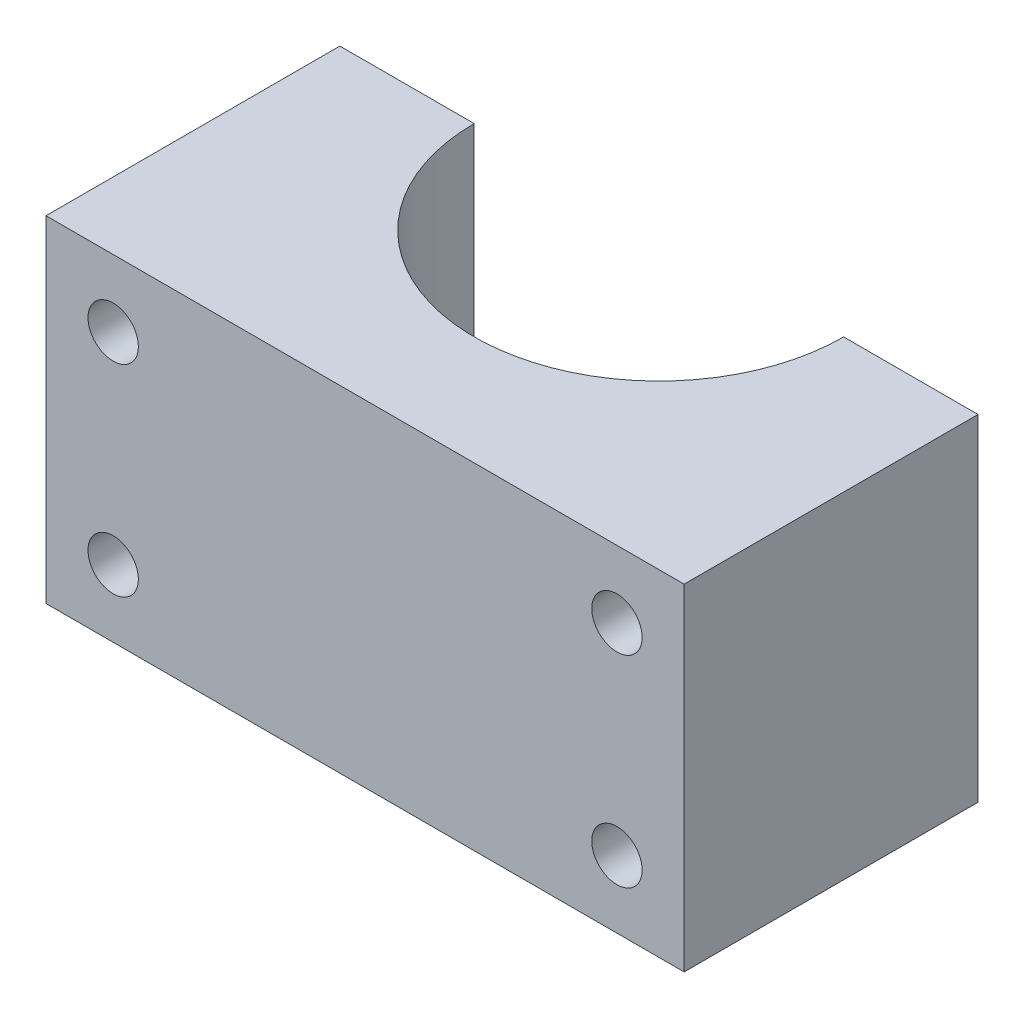
ISO-10303-21;
HEADER;
FILE_DESCRIPTION(('STEP AP214'),'2;1');
FILE_NAME('part.step','',(''),(''),'','','');
FILE_SCHEMA(('AUTOMOTIVE_DESIGN { 1 0 10303 214 1 1 1 1 }'));
ENDSEC;
DATA;
#1=APPLICATION_CONTEXT('core data for automotive mechanical design processes');
#2=APPLICATION_PROTOCOL_DEFINITION('international standard','automotive_design',2000,#1);
#3=PRODUCT_CONTEXT('',#1,'mechanical');
#4=PRODUCT('Part','Part','',(#3));
#5=PRODUCT_RELATED_PRODUCT_CATEGORY('part','',(#4));
#6=PRODUCT_DEFINITION_FORMATION('','',#4);
#7=PRODUCT_DEFINITION_CONTEXT('part definition',#1,'design');
#8=PRODUCT_DEFINITION('design','',#6,#7);
#9=PRODUCT_DEFINITION_SHAPE('','',#8);
#10=(LENGTH_UNIT() NAMED_UNIT(*) SI_UNIT(.MILLI.,.METRE.));
#11=(NAMED_UNIT(*) PLANE_ANGLE_UNIT() SI_UNIT($,.RADIAN.));
#12=(NAMED_UNIT(*) SI_UNIT($,.STERADIAN.) SOLID_ANGLE_UNIT());
#13=UNCERTAINTY_MEASURE_WITH_UNIT(LENGTH_MEASURE(1.E-05),#10,'distance_accuracy_value','');
#14=(GEOMETRIC_REPRESENTATION_CONTEXT(3) GLOBAL_UNCERTAINTY_ASSIGNED_CONTEXT((#13)) GLOBAL_UNIT_ASSIGNED_CONTEXT((#10,
#11,#12)) REPRESENTATION_CONTEXT('',''));
#15=CARTESIAN_POINT('',(0.,0.,0.));
#16=DIRECTION('',(0.,0.,1.));
#17=DIRECTION('',(1.,0.,0.));
#18=AXIS2_PLACEMENT_3D('',#15,#16,#17);
#19=CARTESIAN_POINT('',(-19.,20.,17.5));
#20=DIRECTION('',(1.,0.,0.));
#21=DIRECTION('',(0.,0.,-1.));
#22=AXIS2_PLACEMENT_3D('',#19,#20,#21);
#23=PLANE('',#22);
#24=DIRECTION('',(0.,0.,1.));
#25=VECTOR('',#24,1.);
#26=CARTESIAN_POINT('',(-19.,0.,17.5));
#27=LINE('',#26,#25);
#28=CARTESIAN_POINT('',(-19.,0.,0.));
#29=VERTEX_POINT('',#28);
#30=CARTESIAN_POINT('',(-19.,0.,17.5));
#31=VERTEX_POINT('',#30);
#32=EDGE_CURVE('E121',#29,#31,#27,.T.);
#33=ORIENTED_EDGE('',*,*,#32,.T.);
#34=DIRECTION('',(0.,-1.,0.));
#35=VECTOR('',#34,1.);
#36=CARTESIAN_POINT('',(-19.,20.,17.5));
#37=LINE('',#36,#35);
#38=CARTESIAN_POINT('',(-19.,20.,17.5));
#39=VERTEX_POINT('',#38);
#40=EDGE_CURVE('E11',#39,#31,#37,.T.);
#41=ORIENTED_EDGE('',*,*,#40,.F.);
#42=DIRECTION('',(0.,0.,1.));
#43=VECTOR('',#42,1.);
#44=CARTESIAN_POINT('',(-19.,20.,17.5));
#45=LINE('',#44,#43);
#46=CARTESIAN_POINT('',(-19.,20.,0.));
#47=VERTEX_POINT('',#46);
#48=EDGE_CURVE('E132',#47,#39,#45,.T.);
#49=ORIENTED_EDGE('',*,*,#48,.F.);
#50=DIRECTION('',(0.,-1.,0.));
#51=VECTOR('',#50,1.);
#52=CARTESIAN_POINT('',(-19.,20.,0.));
#53=LINE('',#52,#51);
#54=EDGE_CURVE('E117',#47,#29,#53,.T.);
#55=ORIENTED_EDGE('',*,*,#54,.T.);
#56=EDGE_LOOP('',(#33,#41,#49,#55));
#57=FACE_BOUND('',#56,.T.);
#58=ADVANCED_FACE('F37',(#57),#23,.F.);
#59=CARTESIAN_POINT('',(19.,20.,17.5));
#60=DIRECTION('',(0.,0.,-1.));
#61=DIRECTION('',(-1.,0.,0.));
#62=AXIS2_PLACEMENT_3D('',#59,#60,#61);
#63=PLANE('',#62);
#64=CARTESIAN_POINT('',(15.,16.,17.5));
#65=DIRECTION('',(0.,0.,1.));
#66=DIRECTION('',(1.,0.,0.));
#67=AXIS2_PLACEMENT_3D('',#64,#65,#66);
#68=CIRCLE('',#67,1.5);
#69=CARTESIAN_POINT('',(16.5,16.,17.5));
#70=VERTEX_POINT('',#69);
#71=EDGE_CURVE('E194',#70,#70,#68,.T.);
#72=ORIENTED_EDGE('',*,*,#71,.F.);
#73=EDGE_LOOP('',(#72));
#74=FACE_BOUND('',#73,.T.);
#75=CARTESIAN_POINT('',(15.,4.,17.5));
#76=DIRECTION('',(0.,0.,1.));
#77=DIRECTION('',(1.,0.,0.));
#78=AXIS2_PLACEMENT_3D('',#75,#76,#77);
#79=CIRCLE('',#78,1.5);
#80=CARTESIAN_POINT('',(16.5,4.,17.5));
#81=VERTEX_POINT('',#80);
#82=EDGE_CURVE('E184',#81,#81,#79,.T.);
#83=ORIENTED_EDGE('',*,*,#82,.F.);
#84=EDGE_LOOP('',(#83));
#85=FACE_BOUND('',#84,.T.);
#86=CARTESIAN_POINT('',(-15.,4.,17.5));
#87=DIRECTION('',(0.,0.,1.));
#88=DIRECTION('',(1.,0.,0.));
#89=AXIS2_PLACEMENT_3D('',#86,#87,#88);
#90=CIRCLE('',#89,1.5);
#91=CARTESIAN_POINT('',(-13.5,4.,17.5));
#92=VERTEX_POINT('',#91);
#93=EDGE_CURVE('E183',#92,#92,#90,.T.);
#94=ORIENTED_EDGE('',*,*,#93,.F.);
#95=EDGE_LOOP('',(#94));
#96=FACE_BOUND('',#95,.T.);
#97=CARTESIAN_POINT('',(-15.,16.,17.5));
#98=DIRECTION('',(0.,0.,1.));
#99=DIRECTION('',(1.,0.,0.));
#100=AXIS2_PLACEMENT_3D('',#97,#98,#99);
#101=CIRCLE('',#100,1.5);
#102=CARTESIAN_POINT('',(-13.5,16.,17.5));
#103=VERTEX_POINT('',#102);
#104=EDGE_CURVE('E199',#103,#103,#101,.T.);
#105=ORIENTED_EDGE('',*,*,#104,.F.);
#106=EDGE_LOOP('',(#105));
#107=FACE_BOUND('',#106,.T.);
#108=DIRECTION('',(1.,0.,0.));
#109=VECTOR('',#108,1.);
#110=CARTESIAN_POINT('',(19.,0.,17.5));
#111=LINE('',#110,#109);
#112=CARTESIAN_POINT('',(19.,0.,17.5));
#113=VERTEX_POINT('',#112);
#114=EDGE_CURVE('E124',#31,#113,#111,.T.);
#115=ORIENTED_EDGE('',*,*,#114,.T.);
#116=DIRECTION('',(0.,-1.,0.));
#117=VECTOR('',#116,1.);
#118=CARTESIAN_POINT('',(19.,20.,17.5));
#119=LINE('',#118,#117);
#120=CARTESIAN_POINT('',(19.,20.,17.5));
#121=VERTEX_POINT('',#120);
#122=EDGE_CURVE('E45',#121,#113,#119,.T.);
#123=ORIENTED_EDGE('',*,*,#122,.F.);
#124=DIRECTION('',(1.,0.,0.));
#125=VECTOR('',#124,1.);
#126=CARTESIAN_POINT('',(19.,20.,17.5));
#127=LINE('',#126,#125);
#128=EDGE_CURVE('E90',#39,#121,#127,.T.);
#129=ORIENTED_EDGE('',*,*,#128,.F.);
#130=ORIENTED_EDGE('',*,*,#40,.T.);
#131=EDGE_LOOP('',(#115,#123,#129,#130));
#132=FACE_BOUND('',#131,.T.);
#133=ADVANCED_FACE('F159',(#74,#85,#96,#107,#132),#63,.F.);
#134=CARTESIAN_POINT('',(19.,20.,0.));
#135=DIRECTION('',(-1.,0.,0.));
#136=DIRECTION('',(0.,0.,1.));
#137=AXIS2_PLACEMENT_3D('',#134,#135,#136);
#138=PLANE('',#137);
#139=DIRECTION('',(0.,0.,-1.));
#140=VECTOR('',#139,1.);
#141=CARTESIAN_POINT('',(19.,0.,0.));
#142=LINE('',#141,#140);
#143=CARTESIAN_POINT('',(19.,0.,0.));
#144=VERTEX_POINT('',#143);
#145=EDGE_CURVE('E127',#113,#144,#142,.T.);
#146=ORIENTED_EDGE('',*,*,#145,.T.);
#147=DIRECTION('',(0.,-1.,0.));
#148=VECTOR('',#147,1.);
#149=CARTESIAN_POINT('',(19.,20.,0.));
#150=LINE('',#149,#148);
#151=CARTESIAN_POINT('',(19.,20.,0.));
#152=VERTEX_POINT('',#151);
#153=EDGE_CURVE('E112',#152,#144,#150,.T.);
#154=ORIENTED_EDGE('',*,*,#153,.F.);
#155=DIRECTION('',(0.,0.,-1.));
#156=VECTOR('',#155,1.);
#157=CARTESIAN_POINT('',(19.,20.,0.));
#158=LINE('',#157,#156);
#159=EDGE_CURVE('E103',#121,#152,#158,.T.);
#160=ORIENTED_EDGE('',*,*,#159,.F.);
#161=ORIENTED_EDGE('',*,*,#122,.T.);
#162=EDGE_LOOP('',(#146,#154,#160,#161));
#163=FACE_BOUND('',#162,.T.);
#164=ADVANCED_FACE('F138',(#163),#138,.F.);
#165=CARTESIAN_POINT('',(11.,20.,0.));
#166=DIRECTION('',(0.,0.,1.));
#167=DIRECTION('',(1.,0.,0.));
#168=AXIS2_PLACEMENT_3D('',#165,#166,#167);
#169=PLANE('',#168);
#170=CARTESIAN_POINT('',(15.,16.,0.));
#171=DIRECTION('',(0.,0.,1.));
#172=DIRECTION('',(1.,0.,0.));
#173=AXIS2_PLACEMENT_3D('',#170,#171,#172);
#174=CIRCLE('',#173,1.5);
#175=CARTESIAN_POINT('',(16.5,16.,0.));
#176=VERTEX_POINT('',#175);
#177=EDGE_CURVE('E178',#176,#176,#174,.T.);
#178=ORIENTED_EDGE('',*,*,#177,.T.);
#179=EDGE_LOOP('',(#178));
#180=FACE_BOUND('',#179,.T.);
#181=CARTESIAN_POINT('',(15.,4.,0.));
#182=DIRECTION('',(0.,0.,1.));
#183=DIRECTION('',(1.,0.,0.));
#184=AXIS2_PLACEMENT_3D('',#181,#182,#183);
#185=CIRCLE('',#184,1.5);
#186=CARTESIAN_POINT('',(16.5,4.,0.));
#187=VERTEX_POINT('',#186);
#188=EDGE_CURVE('E181',#187,#187,#185,.T.);
#189=ORIENTED_EDGE('',*,*,#188,.T.);
#190=EDGE_LOOP('',(#189));
#191=FACE_BOUND('',#190,.T.);
#192=DIRECTION('',(-1.,0.,0.));
#193=VECTOR('',#192,1.);
#194=CARTESIAN_POINT('',(11.,0.,0.));
#195=LINE('',#194,#193);
#196=CARTESIAN_POINT('',(11.,0.,0.));
#197=VERTEX_POINT('',#196);
#198=EDGE_CURVE('E111',#144,#197,#195,.T.);
#199=ORIENTED_EDGE('',*,*,#198,.T.);
#200=DIRECTION('',(0.,-1.,0.));
#201=VECTOR('',#200,1.);
#202=CARTESIAN_POINT('',(11.,20.,0.));
#203=LINE('',#202,#201);
#204=CARTESIAN_POINT('',(11.,20.,0.));
#205=VERTEX_POINT('',#204);
#206=EDGE_CURVE('E108',#205,#197,#203,.T.);
#207=ORIENTED_EDGE('',*,*,#206,.F.);
#208=DIRECTION('',(-1.,0.,0.));
#209=VECTOR('',#208,1.);
#210=CARTESIAN_POINT('',(11.,20.,0.));
#211=LINE('',#210,#209);
#212=EDGE_CURVE('E97',#152,#205,#211,.T.);
#213=ORIENTED_EDGE('',*,*,#212,.F.);
#214=ORIENTED_EDGE('',*,*,#153,.T.);
#215=EDGE_LOOP('',(#199,#207,#213,#214));
#216=FACE_BOUND('',#215,.T.);
#217=ADVANCED_FACE('F109',(#180,#191,#216),#169,.F.);
#218=CARTESIAN_POINT('',(0.,20.,0.));
#219=DIRECTION('',(0.,-1.,0.));
#220=DIRECTION('',(0.,0.,-1.));
#221=AXIS2_PLACEMENT_3D('',#218,#219,#220);
#222=CYLINDRICAL_SURFACE('',#221,11.);
#223=CARTESIAN_POINT('',(0.,0.,0.));
#224=DIRECTION('',(0.,-1.,0.));
#225=DIRECTION('',(0.,0.,1.));
#226=AXIS2_PLACEMENT_3D('',#223,#224,#225);
#227=CIRCLE('',#226,11.);
#228=CARTESIAN_POINT('',(-11.,0.,0.));
#229=VERTEX_POINT('',#228);
#230=EDGE_CURVE('E76',#197,#229,#227,.T.);
#231=ORIENTED_EDGE('',*,*,#230,.T.);
#232=DIRECTION('',(0.,-1.,0.));
#233=VECTOR('',#232,1.);
#234=CARTESIAN_POINT('',(-11.,20.,0.));
#235=LINE('',#234,#233);
#236=CARTESIAN_POINT('',(-11.,20.,0.));
#237=VERTEX_POINT('',#236);
#238=EDGE_CURVE('E113',#237,#229,#235,.T.);
#239=ORIENTED_EDGE('',*,*,#238,.F.);
#240=CARTESIAN_POINT('',(0.,20.,0.));
#241=DIRECTION('',(0.,-1.,0.));
#242=DIRECTION('',(0.,0.,1.));
#243=AXIS2_PLACEMENT_3D('',#240,#241,#242);
#244=CIRCLE('',#243,11.);
#245=EDGE_CURVE('E101',#205,#237,#244,.T.);
#246=ORIENTED_EDGE('',*,*,#245,.F.);
#247=ORIENTED_EDGE('',*,*,#206,.T.);
#248=EDGE_LOOP('',(#231,#239,#246,#247));
#249=FACE_BOUND('',#248,.T.);
#250=ADVANCED_FACE('F115',(#249),#222,.F.);
#251=CARTESIAN_POINT('',(-19.,20.,0.));
#252=DIRECTION('',(0.,0.,1.));
#253=DIRECTION('',(1.,0.,0.));
#254=AXIS2_PLACEMENT_3D('',#251,#252,#253);
#255=PLANE('',#254);
#256=CARTESIAN_POINT('',(-15.,4.,0.));
#257=DIRECTION('',(0.,0.,1.));
#258=DIRECTION('',(1.,0.,0.));
#259=AXIS2_PLACEMENT_3D('',#256,#257,#258);
#260=CIRCLE('',#259,1.5);
#261=CARTESIAN_POINT('',(-13.5,4.,0.));
#262=VERTEX_POINT('',#261);
#263=EDGE_CURVE('E187',#262,#262,#260,.T.);
#264=ORIENTED_EDGE('',*,*,#263,.T.);
#265=EDGE_LOOP('',(#264));
#266=FACE_BOUND('',#265,.T.);
#267=CARTESIAN_POINT('',(-15.,16.,0.));
#268=DIRECTION('',(0.,0.,1.));
#269=DIRECTION('',(1.,0.,0.));
#270=AXIS2_PLACEMENT_3D('',#267,#268,#269);
#271=CIRCLE('',#270,1.5);
#272=CARTESIAN_POINT('',(-13.5,16.,0.));
#273=VERTEX_POINT('',#272);
#274=EDGE_CURVE('E125',#273,#273,#271,.T.);
#275=ORIENTED_EDGE('',*,*,#274,.T.);
#276=EDGE_LOOP('',(#275));
#277=FACE_BOUND('',#276,.T.);
#278=DIRECTION('',(-1.,0.,0.));
#279=VECTOR('',#278,1.);
#280=CARTESIAN_POINT('',(-19.,0.,0.));
#281=LINE('',#280,#279);
#282=EDGE_CURVE('E82',#229,#29,#281,.T.);
#283=ORIENTED_EDGE('',*,*,#282,.T.);
#284=ORIENTED_EDGE('',*,*,#54,.F.);
#285=DIRECTION('',(-1.,0.,0.));
#286=VECTOR('',#285,1.);
#287=CARTESIAN_POINT('',(-19.,20.,0.));
#288=LINE('',#287,#286);
#289=EDGE_CURVE('E53',#237,#47,#288,.T.);
#290=ORIENTED_EDGE('',*,*,#289,.F.);
#291=ORIENTED_EDGE('',*,*,#238,.T.);
#292=EDGE_LOOP('',(#283,#284,#290,#291));
#293=FACE_BOUND('',#292,.T.);
#294=ADVANCED_FACE('F145',(#266,#277,#293),#255,.F.);
#295=CARTESIAN_POINT('',(0.,20.,0.));
#296=DIRECTION('',(0.,1.,0.));
#297=DIRECTION('',(0.,0.,1.));
#298=AXIS2_PLACEMENT_3D('',#295,#296,#297);
#299=PLANE('',#298);
#300=ORIENTED_EDGE('',*,*,#48,.T.);
#301=ORIENTED_EDGE('',*,*,#128,.T.);
#302=ORIENTED_EDGE('',*,*,#159,.T.);
#303=ORIENTED_EDGE('',*,*,#212,.T.);
#304=ORIENTED_EDGE('',*,*,#245,.T.);
#305=ORIENTED_EDGE('',*,*,#289,.T.);
#306=EDGE_LOOP('',(#300,#301,#302,#303,#304,#305));
#307=FACE_BOUND('',#306,.T.);
#308=ADVANCED_FACE('F99',(#307),#299,.T.);
#309=CARTESIAN_POINT('',(0.,0.,0.));
#310=DIRECTION('',(0.,1.,0.));
#311=DIRECTION('',(0.,0.,1.));
#312=AXIS2_PLACEMENT_3D('',#309,#310,#311);
#313=PLANE('',#312);
#314=ORIENTED_EDGE('',*,*,#32,.F.);
#315=ORIENTED_EDGE('',*,*,#282,.F.);
#316=ORIENTED_EDGE('',*,*,#230,.F.);
#317=ORIENTED_EDGE('',*,*,#198,.F.);
#318=ORIENTED_EDGE('',*,*,#145,.F.);
#319=ORIENTED_EDGE('',*,*,#114,.F.);
#320=EDGE_LOOP('',(#314,#315,#316,#317,#318,#319));
#321=FACE_BOUND('',#320,.T.);
#322=ADVANCED_FACE('F141',(#321),#313,.F.);
#323=CARTESIAN_POINT('',(-15.,16.,0.));
#324=DIRECTION('',(0.,0.,1.));
#325=DIRECTION('',(1.,0.,0.));
#326=AXIS2_PLACEMENT_3D('',#323,#324,#325);
#327=CYLINDRICAL_SURFACE('',#326,1.5);
#328=ORIENTED_EDGE('',*,*,#274,.F.);
#329=EDGE_LOOP('',(#328));
#330=FACE_BOUND('',#329,.T.);
#331=ORIENTED_EDGE('',*,*,#104,.T.);
#332=EDGE_LOOP('',(#331));
#333=FACE_BOUND('',#332,.T.);
#334=ADVANCED_FACE('F211',(#330,#333),#327,.F.);
#335=CARTESIAN_POINT('',(-15.,4.,0.));
#336=DIRECTION('',(0.,0.,1.));
#337=DIRECTION('',(1.,0.,0.));
#338=AXIS2_PLACEMENT_3D('',#335,#336,#337);
#339=CYLINDRICAL_SURFACE('',#338,1.5);
#340=ORIENTED_EDGE('',*,*,#263,.F.);
#341=EDGE_LOOP('',(#340));
#342=FACE_BOUND('',#341,.T.);
#343=ORIENTED_EDGE('',*,*,#93,.T.);
#344=EDGE_LOOP('',(#343));
#345=FACE_BOUND('',#344,.T.);
#346=ADVANCED_FACE('F207',(#342,#345),#339,.F.);
#347=CARTESIAN_POINT('',(15.,4.,0.));
#348=DIRECTION('',(0.,0.,1.));
#349=DIRECTION('',(1.,0.,0.));
#350=AXIS2_PLACEMENT_3D('',#347,#348,#349);
#351=CYLINDRICAL_SURFACE('',#350,1.5);
#352=ORIENTED_EDGE('',*,*,#188,.F.);
#353=EDGE_LOOP('',(#352));
#354=FACE_BOUND('',#353,.T.);
#355=ORIENTED_EDGE('',*,*,#82,.T.);
#356=EDGE_LOOP('',(#355));
#357=FACE_BOUND('',#356,.T.);
#358=ADVANCED_FACE('F210',(#354,#357),#351,.F.);
#359=CARTESIAN_POINT('',(15.,16.,0.));
#360=DIRECTION('',(0.,0.,1.));
#361=DIRECTION('',(1.,0.,0.));
#362=AXIS2_PLACEMENT_3D('',#359,#360,#361);
#363=CYLINDRICAL_SURFACE('',#362,1.5);
#364=ORIENTED_EDGE('',*,*,#177,.F.);
#365=EDGE_LOOP('',(#364));
#366=FACE_BOUND('',#365,.T.);
#367=ORIENTED_EDGE('',*,*,#71,.T.);
#368=EDGE_LOOP('',(#367));
#369=FACE_BOUND('',#368,.T.);
#370=ADVANCED_FACE('F220',(#366,#369),#363,.F.);
#371=CLOSED_SHELL('',(#58,#133,#164,#217,#250,#294,#308,#322,#334,#346,#358,#370));
#372=MANIFOLD_SOLID_BREP('B2',#371);
#373=ADVANCED_BREP_SHAPE_REPRESENTATION('',(#18,#372),#14);
#374=SHAPE_DEFINITION_REPRESENTATION(#9,#373);
ENDSEC;
END-ISO-10303-21;
